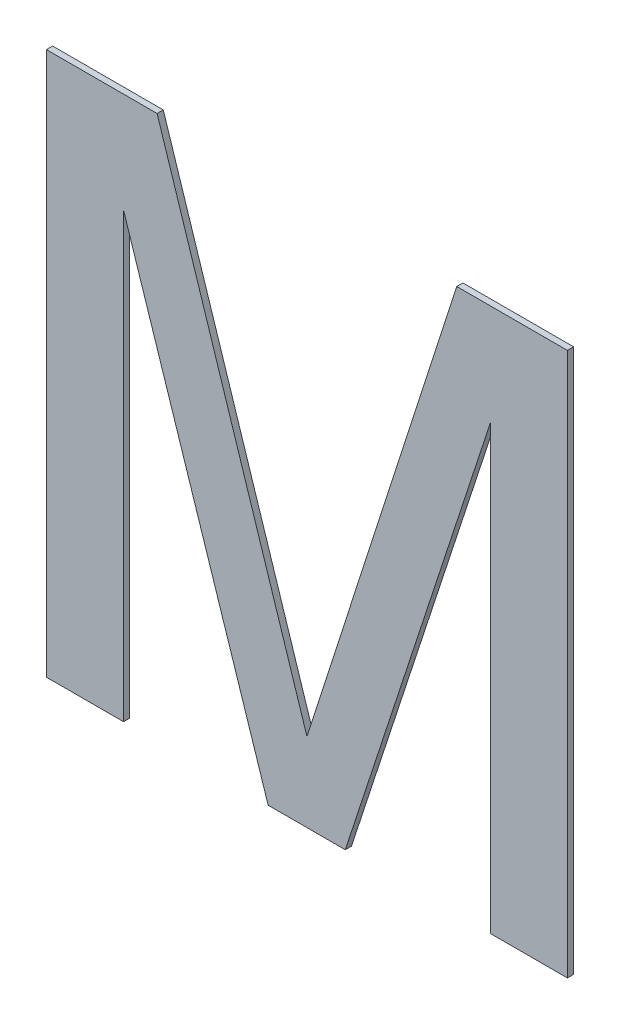
ISO-10303-21;
HEADER;
FILE_DESCRIPTION(('STEP AP214'),'2;1');
FILE_NAME('part.step','',(''),(''),'','','');
FILE_SCHEMA(('AUTOMOTIVE_DESIGN { 1 0 10303 214 1 1 1 1 }'));
ENDSEC;
DATA;
#1=APPLICATION_CONTEXT('core data for automotive mechanical design processes');
#2=APPLICATION_PROTOCOL_DEFINITION('international standard','automotive_design',2000,#1);
#3=PRODUCT_CONTEXT('',#1,'mechanical');
#4=PRODUCT('Part','Part','',(#3));
#5=PRODUCT_RELATED_PRODUCT_CATEGORY('part','',(#4));
#6=PRODUCT_DEFINITION_FORMATION('','',#4);
#7=PRODUCT_DEFINITION_CONTEXT('part definition',#1,'design');
#8=PRODUCT_DEFINITION('design','',#6,#7);
#9=PRODUCT_DEFINITION_SHAPE('','',#8);
#10=(LENGTH_UNIT() NAMED_UNIT(*) SI_UNIT(.MILLI.,.METRE.));
#11=(NAMED_UNIT(*) PLANE_ANGLE_UNIT() SI_UNIT($,.RADIAN.));
#12=(NAMED_UNIT(*) SI_UNIT($,.STERADIAN.) SOLID_ANGLE_UNIT());
#13=UNCERTAINTY_MEASURE_WITH_UNIT(LENGTH_MEASURE(1.E-05),#10,'distance_accuracy_value','');
#14=(GEOMETRIC_REPRESENTATION_CONTEXT(3) GLOBAL_UNCERTAINTY_ASSIGNED_CONTEXT((#13)) GLOBAL_UNIT_ASSIGNED_CONTEXT((#10,
#11,#12)) REPRESENTATION_CONTEXT('',''));
#15=CARTESIAN_POINT('',(0.,0.,0.));
#16=DIRECTION('',(0.,0.,1.));
#17=DIRECTION('',(1.,0.,0.));
#18=AXIS2_PLACEMENT_3D('',#15,#16,#17);
#19=CARTESIAN_POINT('',(-0.940270283559812,1.83389408249228,-3.53695));
#20=DIRECTION('',(0.,0.,1.));
#21=DIRECTION('',(1.,0.,0.));
#22=AXIS2_PLACEMENT_3D('',#19,#20,#21);
#23=PLANE('',#22);
#24=DIRECTION('',(1.,0.,0.));
#25=VECTOR('',#24,1.);
#26=CARTESIAN_POINT('',(-0.712084175447292,1.55449408249228,-3.53695));
#27=LINE('',#26,#25);
#28=CARTESIAN_POINT('',(-0.672440828517736,1.55449408249228,-3.53695));
#29=VERTEX_POINT('',#28);
#30=CARTESIAN_POINT('',(-0.751727522376848,1.55449408249228,-3.53695));
#31=VERTEX_POINT('',#30);
#32=EDGE_CURVE('E165',#29,#31,#27,.F.);
#33=ORIENTED_EDGE('',*,*,#32,.T.);
#34=DIRECTION('',(0.,1.,0.));
#35=VECTOR('',#34,1.);
#36=CARTESIAN_POINT('',(-0.751727522376848,1.78173182159044,-3.53695));
#37=LINE('',#36,#35);
#38=CARTESIAN_POINT('',(-0.751727522376849,2.00896956068861,-3.53695));
#39=VERTEX_POINT('',#38);
#40=EDGE_CURVE('E161',#31,#39,#37,.T.);
#41=ORIENTED_EDGE('',*,*,#40,.T.);
#42=DIRECTION('',(0.311703156279007,0.950179531649522,0.));
#43=VECTOR('',#42,1.);
#44=CARTESIAN_POINT('',(-0.8262720880545,1.78173182159044,-3.53695));
#45=LINE('',#44,#43);
#46=CARTESIAN_POINT('',(-0.90081665373215,1.55449408249228,-3.53695));
#47=VERTEX_POINT('',#46);
#48=EDGE_CURVE('E158',#47,#39,#45,.T.);
#49=ORIENTED_EDGE('',*,*,#48,.F.);
#50=DIRECTION('',(1.,0.,0.));
#51=VECTOR('',#50,1.);
#52=CARTESIAN_POINT('',(-0.940460000661708,1.55449408249228,-3.53695));
#53=LINE('',#52,#51);
#54=CARTESIAN_POINT('',(-0.980103347591281,1.55449408249228,-3.53695));
#55=VERTEX_POINT('',#54);
#56=EDGE_CURVE('E151',#47,#55,#53,.F.);
#57=ORIENTED_EDGE('',*,*,#56,.T.);
#58=DIRECTION('',(-0.310284971764103,0.950643590572908,0.));
#59=VECTOR('',#58,1.);
#60=CARTESIAN_POINT('',(-1.05445826278106,1.78230087297533,-3.53695));
#61=LINE('',#60,#59);
#62=CARTESIAN_POINT('',(-1.12881317797064,2.01010766345836,-3.53695));
#63=VERTEX_POINT('',#62);
#64=EDGE_CURVE('E147',#55,#63,#61,.T.);
#65=ORIENTED_EDGE('',*,*,#64,.T.);
#66=DIRECTION('',(0.,1.,0.));
#67=VECTOR('',#66,1.);
#68=CARTESIAN_POINT('',(-1.1288131779706,1.78230087297533,-3.53695));
#69=LINE('',#68,#67);
#70=CARTESIAN_POINT('',(-1.1288131779706,1.55449408249228,-3.53695));
#71=VERTEX_POINT('',#70);
#72=EDGE_CURVE('E144',#71,#63,#69,.T.);
#73=ORIENTED_EDGE('',*,*,#72,.F.);
#74=DIRECTION('',(1.,0.,0.));
#75=VECTOR('',#74,1.);
#76=CARTESIAN_POINT('',(-1.16845645828612,1.55449408249228,-3.53695));
#77=LINE('',#76,#75);
#78=CARTESIAN_POINT('',(-1.20809973860163,1.55449408249228,-3.53695));
#79=VERTEX_POINT('',#78);
#80=EDGE_CURVE('E137',#71,#79,#77,.F.);
#81=ORIENTED_EDGE('',*,*,#80,.T.);
#82=DIRECTION('',(0.,1.,0.));
#83=VECTOR('',#82,1.);
#84=CARTESIAN_POINT('',(-1.20809973860163,1.83389408249228,-3.53695));
#85=LINE('',#84,#83);
#86=CARTESIAN_POINT('',(-1.20809973860163,2.11329408249228,-3.53695));
#87=VERTEX_POINT('',#86);
#88=EDGE_CURVE('E133',#79,#87,#85,.T.);
#89=ORIENTED_EDGE('',*,*,#88,.T.);
#90=DIRECTION('',(1.,0.,0.));
#91=VECTOR('',#90,1.);
#92=CARTESIAN_POINT('',(-1.15119546609291,2.11329408249228,-3.53695));
#93=LINE('',#92,#91);
#94=CARTESIAN_POINT('',(-1.09429119358416,2.11329408249229,-3.53695));
#95=VERTEX_POINT('',#94);
#96=EDGE_CURVE('E122',#95,#87,#93,.F.);
#97=ORIENTED_EDGE('',*,*,#96,.F.);
#98=DIRECTION('',(-0.306914308852398,0.951737152275593,0.));
#99=VECTOR('',#98,1.);
#100=CARTESIAN_POINT('',(-1.01728077187889,1.8744857984362,-3.53695));
#101=LINE('',#100,#99);
#102=CARTESIAN_POINT('',(-0.940270350173881,1.63567751437991,-3.53695));
#103=VERTEX_POINT('',#102);
#104=EDGE_CURVE('E108',#103,#95,#101,.T.);
#105=ORIENTED_EDGE('',*,*,#104,.F.);
#106=DIRECTION('',(0.306914549326605,0.951737074727914,0.));
#107=VECTOR('',#106,1.);
#108=CARTESIAN_POINT('',(-0.863259861854522,1.8744857984362,-3.53695));
#109=LINE('',#108,#107);
#110=CARTESIAN_POINT('',(-0.786249373534965,2.11329408249229,-3.53695));
#111=VERTEX_POINT('',#110);
#112=EDGE_CURVE('E19',#103,#111,#109,.T.);
#113=ORIENTED_EDGE('',*,*,#112,.T.);
#114=DIRECTION('',(1.,0.,0.));
#115=VECTOR('',#114,1.);
#116=CARTESIAN_POINT('',(-0.72934510102621,2.11329408249228,-3.53695));
#117=LINE('',#116,#115);
#118=CARTESIAN_POINT('',(-0.672440828517736,2.11329408249228,-3.53695));
#119=VERTEX_POINT('',#118);
#120=EDGE_CURVE('E175',#119,#111,#117,.F.);
#121=ORIENTED_EDGE('',*,*,#120,.F.);
#122=DIRECTION('',(0.,1.,0.));
#123=VECTOR('',#122,1.);
#124=CARTESIAN_POINT('',(-0.672440828517736,1.83389408249228,-3.53695));
#125=LINE('',#124,#123);
#126=EDGE_CURVE('E172',#29,#119,#125,.T.);
#127=ORIENTED_EDGE('',*,*,#126,.F.);
#128=EDGE_LOOP('',(#33,#41,#49,#57,#65,#73,#81,#89,#97,#105,#113,#121,#127));
#129=FACE_BOUND('',#128,.T.);
#130=ADVANCED_FACE('F16',(#129),#23,.F.);
#131=CARTESIAN_POINT('',(-0.863259861854522,1.8744857984362,-3.533775));
#132=DIRECTION('',(0.951737074727914,-0.306914549326605,0.));
#133=DIRECTION('',(0.306914549326605,0.951737074727914,0.));
#134=AXIS2_PLACEMENT_3D('',#131,#132,#133);
#135=PLANE('',#134);
#136=ORIENTED_EDGE('',*,*,#112,.F.);
#137=DIRECTION('',(0.,0.,1.));
#138=VECTOR('',#137,1.);
#139=CARTESIAN_POINT('',(-0.940270350173581,1.63567751437994,-3.533775));
#140=LINE('',#139,#138);
#141=CARTESIAN_POINT('',(-0.940270350173881,1.63567751437991,-3.5306));
#142=VERTEX_POINT('',#141);
#143=EDGE_CURVE('E114',#142,#103,#140,.F.);
#144=ORIENTED_EDGE('',*,*,#143,.F.);
#145=DIRECTION('',(-0.306914549326437,-0.951737074727968,0.));
#146=VECTOR('',#145,1.);
#147=CARTESIAN_POINT('',(-0.786249373534938,2.11329408249228,-3.5306));
#148=LINE('',#147,#146);
#149=CARTESIAN_POINT('',(-0.786249373534993,2.1132940824923,-3.5306));
#150=VERTEX_POINT('',#149);
#151=EDGE_CURVE('E178',#150,#142,#148,.T.);
#152=ORIENTED_EDGE('',*,*,#151,.F.);
#153=DIRECTION('',(0.,0.,1.));
#154=VECTOR('',#153,1.);
#155=CARTESIAN_POINT('',(-0.786249373534938,2.11329408249228,-3.533775));
#156=LINE('',#155,#154);
#157=EDGE_CURVE('E117',#111,#150,#156,.T.);
#158=ORIENTED_EDGE('',*,*,#157,.F.);
#159=EDGE_LOOP('',(#136,#144,#152,#158));
#160=FACE_BOUND('',#159,.T.);
#161=ADVANCED_FACE('F113',(#160),#135,.F.);
#162=CARTESIAN_POINT('',(-1.01728077187889,1.8744857984362,-3.533775));
#163=DIRECTION('',(0.951737152275593,0.306914308852398,0.));
#164=DIRECTION('',(-0.306914308852398,0.951737152275593,0.));
#165=AXIS2_PLACEMENT_3D('',#162,#163,#164);
#166=PLANE('',#165);
#167=DIRECTION('',(0.,0.,1.));
#168=VECTOR('',#167,1.);
#169=CARTESIAN_POINT('',(-1.09429119358418,2.11329408249228,-3.533775));
#170=LINE('',#169,#168);
#171=CARTESIAN_POINT('',(-1.09429119358416,2.11329408249229,-3.5306));
#172=VERTEX_POINT('',#171);
#173=EDGE_CURVE('E124',#172,#95,#170,.F.);
#174=ORIENTED_EDGE('',*,*,#173,.F.);
#175=DIRECTION('',(-0.306914308851923,0.951737152275746,0.));
#176=VECTOR('',#175,1.);
#177=CARTESIAN_POINT('',(-0.940270350173852,1.63567751437986,-3.5306));
#178=LINE('',#177,#176);
#179=EDGE_CURVE('E128',#142,#172,#178,.T.);
#180=ORIENTED_EDGE('',*,*,#179,.F.);
#181=ORIENTED_EDGE('',*,*,#143,.T.);
#182=ORIENTED_EDGE('',*,*,#104,.T.);
#183=EDGE_LOOP('',(#174,#180,#181,#182));
#184=FACE_BOUND('',#183,.T.);
#185=ADVANCED_FACE('F126',(#184),#166,.T.);
#186=CARTESIAN_POINT('',(-1.15119546609291,2.11329408249228,-3.533775));
#187=DIRECTION('',(0.,1.,0.));
#188=DIRECTION('',(0.,0.,1.));
#189=AXIS2_PLACEMENT_3D('',#186,#187,#188);
#190=PLANE('',#189);
#191=DIRECTION('',(0.,0.,-1.));
#192=VECTOR('',#191,1.);
#193=CARTESIAN_POINT('',(-1.20809973860163,2.11329408249228,-3.533775));
#194=LINE('',#193,#192);
#195=CARTESIAN_POINT('',(-1.20809973860163,2.11329408249228,-3.5306));
#196=VERTEX_POINT('',#195);
#197=EDGE_CURVE('E135',#87,#196,#194,.F.);
#198=ORIENTED_EDGE('',*,*,#197,.T.);
#199=DIRECTION('',(1.,0.,0.));
#200=VECTOR('',#199,1.);
#201=CARTESIAN_POINT('',(-0.940270283559812,2.11329408249228,-3.5306));
#202=LINE('',#201,#200);
#203=EDGE_CURVE('E181',#172,#196,#202,.F.);
#204=ORIENTED_EDGE('',*,*,#203,.F.);
#205=ORIENTED_EDGE('',*,*,#173,.T.);
#206=ORIENTED_EDGE('',*,*,#96,.T.);
#207=EDGE_LOOP('',(#198,#204,#205,#206));
#208=FACE_BOUND('',#207,.T.);
#209=ADVANCED_FACE('F259',(#208),#190,.T.);
#210=CARTESIAN_POINT('',(-1.20809973860163,1.83389408249228,-3.533775));
#211=DIRECTION('',(1.,0.,0.));
#212=DIRECTION('',(0.,0.,-1.));
#213=AXIS2_PLACEMENT_3D('',#210,#211,#212);
#214=PLANE('',#213);
#215=ORIENTED_EDGE('',*,*,#88,.F.);
#216=DIRECTION('',(0.,0.,1.));
#217=VECTOR('',#216,1.);
#218=CARTESIAN_POINT('',(-1.20809973860163,1.55449408249228,-3.533775));
#219=LINE('',#218,#217);
#220=CARTESIAN_POINT('',(-1.20809973860163,1.55449408249228,-3.5306));
#221=VERTEX_POINT('',#220);
#222=EDGE_CURVE('E139',#79,#221,#219,.T.);
#223=ORIENTED_EDGE('',*,*,#222,.T.);
#224=DIRECTION('',(0.,1.,0.));
#225=VECTOR('',#224,1.);
#226=CARTESIAN_POINT('',(-1.20809973860163,1.83389408249228,-3.5306));
#227=LINE('',#226,#225);
#228=EDGE_CURVE('E184',#196,#221,#227,.F.);
#229=ORIENTED_EDGE('',*,*,#228,.F.);
#230=ORIENTED_EDGE('',*,*,#197,.F.);
#231=EDGE_LOOP('',(#215,#223,#229,#230));
#232=FACE_BOUND('',#231,.T.);
#233=ADVANCED_FACE('F255',(#232),#214,.F.);
#234=CARTESIAN_POINT('',(-1.16845645828612,1.55449408249228,-3.533775));
#235=DIRECTION('',(0.,1.,0.));
#236=DIRECTION('',(0.,0.,1.));
#237=AXIS2_PLACEMENT_3D('',#234,#235,#236);
#238=PLANE('',#237);
#239=ORIENTED_EDGE('',*,*,#80,.F.);
#240=DIRECTION('',(0.,0.,-1.));
#241=VECTOR('',#240,1.);
#242=CARTESIAN_POINT('',(-1.1288131779706,1.55449408249228,-3.533775));
#243=LINE('',#242,#241);
#244=CARTESIAN_POINT('',(-1.1288131779706,1.55449408249228,-3.5306));
#245=VERTEX_POINT('',#244);
#246=EDGE_CURVE('E141',#245,#71,#243,.T.);
#247=ORIENTED_EDGE('',*,*,#246,.F.);
#248=DIRECTION('',(1.,0.,0.));
#249=VECTOR('',#248,1.);
#250=CARTESIAN_POINT('',(-0.940270283559812,1.55449408249228,-3.5306));
#251=LINE('',#250,#249);
#252=EDGE_CURVE('E187',#221,#245,#251,.T.);
#253=ORIENTED_EDGE('',*,*,#252,.F.);
#254=ORIENTED_EDGE('',*,*,#222,.F.);
#255=EDGE_LOOP('',(#239,#247,#253,#254));
#256=FACE_BOUND('',#255,.T.);
#257=ADVANCED_FACE('F251',(#256),#238,.F.);
#258=CARTESIAN_POINT('',(-1.1288131779706,1.78230087297533,-3.533775));
#259=DIRECTION('',(1.,0.,0.));
#260=DIRECTION('',(0.,0.,-1.));
#261=AXIS2_PLACEMENT_3D('',#258,#259,#260);
#262=PLANE('',#261);
#263=DIRECTION('',(0.,0.,1.));
#264=VECTOR('',#263,1.);
#265=CARTESIAN_POINT('',(-1.12881317797077,2.01010766345832,-3.533775));
#266=LINE('',#265,#264);
#267=CARTESIAN_POINT('',(-1.12881317797064,2.01010766345836,-3.5306));
#268=VERTEX_POINT('',#267);
#269=EDGE_CURVE('E149',#63,#268,#266,.T.);
#270=ORIENTED_EDGE('',*,*,#269,.T.);
#271=DIRECTION('',(0.,1.,0.));
#272=VECTOR('',#271,1.);
#273=CARTESIAN_POINT('',(-1.1288131779706,1.83389408249228,-3.5306));
#274=LINE('',#273,#272);
#275=EDGE_CURVE('E190',#245,#268,#274,.T.);
#276=ORIENTED_EDGE('',*,*,#275,.F.);
#277=ORIENTED_EDGE('',*,*,#246,.T.);
#278=ORIENTED_EDGE('',*,*,#72,.T.);
#279=EDGE_LOOP('',(#270,#276,#277,#278));
#280=FACE_BOUND('',#279,.T.);
#281=ADVANCED_FACE('F247',(#280),#262,.T.);
#282=CARTESIAN_POINT('',(-1.05445826278106,1.78230087297533,-3.533775));
#283=DIRECTION('',(0.950643590572908,0.310284971764103,0.));
#284=DIRECTION('',(-0.310284971764103,0.950643590572908,0.));
#285=AXIS2_PLACEMENT_3D('',#282,#283,#284);
#286=PLANE('',#285);
#287=ORIENTED_EDGE('',*,*,#64,.F.);
#288=DIRECTION('',(0.,0.,1.));
#289=VECTOR('',#288,1.);
#290=CARTESIAN_POINT('',(-0.980103347591264,1.55449408249228,-3.533775));
#291=LINE('',#290,#289);
#292=CARTESIAN_POINT('',(-0.980103347591297,1.55449408249227,-3.5306));
#293=VERTEX_POINT('',#292);
#294=EDGE_CURVE('E153',#55,#293,#291,.T.);
#295=ORIENTED_EDGE('',*,*,#294,.T.);
#296=DIRECTION('',(0.3102849717639,-0.950643590572974,0.));
#297=VECTOR('',#296,1.);
#298=CARTESIAN_POINT('',(-1.1288131779706,2.01010766345837,-3.5306));
#299=LINE('',#298,#297);
#300=EDGE_CURVE('E193',#268,#293,#299,.T.);
#301=ORIENTED_EDGE('',*,*,#300,.F.);
#302=ORIENTED_EDGE('',*,*,#269,.F.);
#303=EDGE_LOOP('',(#287,#295,#301,#302));
#304=FACE_BOUND('',#303,.T.);
#305=ADVANCED_FACE('F243',(#304),#286,.F.);
#306=CARTESIAN_POINT('',(-0.940460000661708,1.55449408249228,-3.533775));
#307=DIRECTION('',(0.,1.,0.));
#308=DIRECTION('',(0.,0.,1.));
#309=AXIS2_PLACEMENT_3D('',#306,#307,#308);
#310=PLANE('',#309);
#311=ORIENTED_EDGE('',*,*,#56,.F.);
#312=DIRECTION('',(0.,0.,1.));
#313=VECTOR('',#312,1.);
#314=CARTESIAN_POINT('',(-0.900816653732147,1.55449408249228,-3.533775));
#315=LINE('',#314,#313);
#316=CARTESIAN_POINT('',(-0.90081665373215,1.55449408249228,-3.5306));
#317=VERTEX_POINT('',#316);
#318=EDGE_CURVE('E155',#317,#47,#315,.F.);
#319=ORIENTED_EDGE('',*,*,#318,.F.);
#320=DIRECTION('',(1.,0.,0.));
#321=VECTOR('',#320,1.);
#322=CARTESIAN_POINT('',(-0.940270283559812,1.55449408249228,-3.5306));
#323=LINE('',#322,#321);
#324=EDGE_CURVE('E196',#293,#317,#323,.T.);
#325=ORIENTED_EDGE('',*,*,#324,.F.);
#326=ORIENTED_EDGE('',*,*,#294,.F.);
#327=EDGE_LOOP('',(#311,#319,#325,#326));
#328=FACE_BOUND('',#327,.T.);
#329=ADVANCED_FACE('F239',(#328),#310,.F.);
#330=CARTESIAN_POINT('',(-0.8262720880545,1.78173182159044,-3.533775));
#331=DIRECTION('',(0.950179531649522,-0.311703156279007,0.));
#332=DIRECTION('',(0.311703156279007,0.950179531649522,0.));
#333=AXIS2_PLACEMENT_3D('',#330,#331,#332);
#334=PLANE('',#333);
#335=DIRECTION('',(0.,0.,-1.));
#336=VECTOR('',#335,1.);
#337=CARTESIAN_POINT('',(-0.751727522376848,2.00896956068861,-3.533775));
#338=LINE('',#337,#336);
#339=CARTESIAN_POINT('',(-0.751727522376851,2.00896956068861,-3.5306));
#340=VERTEX_POINT('',#339);
#341=EDGE_CURVE('E163',#39,#340,#338,.F.);
#342=ORIENTED_EDGE('',*,*,#341,.T.);
#343=DIRECTION('',(0.31170315627903,0.950179531649514,0.));
#344=VECTOR('',#343,1.);
#345=CARTESIAN_POINT('',(-0.900816653732152,1.55449408249228,-3.5306));
#346=LINE('',#345,#344);
#347=EDGE_CURVE('E199',#317,#340,#346,.T.);
#348=ORIENTED_EDGE('',*,*,#347,.F.);
#349=ORIENTED_EDGE('',*,*,#318,.T.);
#350=ORIENTED_EDGE('',*,*,#48,.T.);
#351=EDGE_LOOP('',(#342,#348,#349,#350));
#352=FACE_BOUND('',#351,.T.);
#353=ADVANCED_FACE('F235',(#352),#334,.T.);
#354=CARTESIAN_POINT('',(-0.751727522376848,1.78173182159044,-3.533775));
#355=DIRECTION('',(1.,0.,0.));
#356=DIRECTION('',(0.,0.,-1.));
#357=AXIS2_PLACEMENT_3D('',#354,#355,#356);
#358=PLANE('',#357);
#359=ORIENTED_EDGE('',*,*,#40,.F.);
#360=DIRECTION('',(0.,0.,1.));
#361=VECTOR('',#360,1.);
#362=CARTESIAN_POINT('',(-0.751727522376848,1.55449408249228,-3.533775));
#363=LINE('',#362,#361);
#364=CARTESIAN_POINT('',(-0.751727522376848,1.55449408249228,-3.5306));
#365=VERTEX_POINT('',#364);
#366=EDGE_CURVE('E167',#31,#365,#363,.T.);
#367=ORIENTED_EDGE('',*,*,#366,.T.);
#368=DIRECTION('',(0.,1.,0.));
#369=VECTOR('',#368,1.);
#370=CARTESIAN_POINT('',(-0.751727522376848,1.83389408249228,-3.5306));
#371=LINE('',#370,#369);
#372=EDGE_CURVE('E202',#340,#365,#371,.F.);
#373=ORIENTED_EDGE('',*,*,#372,.F.);
#374=ORIENTED_EDGE('',*,*,#341,.F.);
#375=EDGE_LOOP('',(#359,#367,#373,#374));
#376=FACE_BOUND('',#375,.T.);
#377=ADVANCED_FACE('F232',(#376),#358,.F.);
#378=CARTESIAN_POINT('',(-0.712084175447292,1.55449408249228,-3.533775));
#379=DIRECTION('',(0.,1.,0.));
#380=DIRECTION('',(0.,0.,1.));
#381=AXIS2_PLACEMENT_3D('',#378,#379,#380);
#382=PLANE('',#381);
#383=ORIENTED_EDGE('',*,*,#32,.F.);
#384=DIRECTION('',(0.,0.,-1.));
#385=VECTOR('',#384,1.);
#386=CARTESIAN_POINT('',(-0.672440828517736,1.55449408249228,-3.533775));
#387=LINE('',#386,#385);
#388=CARTESIAN_POINT('',(-0.672440828517736,1.55449408249228,-3.5306));
#389=VERTEX_POINT('',#388);
#390=EDGE_CURVE('E169',#389,#29,#387,.T.);
#391=ORIENTED_EDGE('',*,*,#390,.F.);
#392=DIRECTION('',(1.,0.,0.));
#393=VECTOR('',#392,1.);
#394=CARTESIAN_POINT('',(-0.940270283559812,1.55449408249228,-3.5306));
#395=LINE('',#394,#393);
#396=EDGE_CURVE('E205',#365,#389,#395,.T.);
#397=ORIENTED_EDGE('',*,*,#396,.F.);
#398=ORIENTED_EDGE('',*,*,#366,.F.);
#399=EDGE_LOOP('',(#383,#391,#397,#398));
#400=FACE_BOUND('',#399,.T.);
#401=ADVANCED_FACE('F215',(#400),#382,.F.);
#402=CARTESIAN_POINT('',(-0.672440828517736,1.83389408249228,-3.533775));
#403=DIRECTION('',(1.,0.,0.));
#404=DIRECTION('',(0.,0.,-1.));
#405=AXIS2_PLACEMENT_3D('',#402,#403,#404);
#406=PLANE('',#405);
#407=DIRECTION('',(0.,0.,1.));
#408=VECTOR('',#407,1.);
#409=CARTESIAN_POINT('',(-0.672440828517736,2.11329408249228,-3.533775));
#410=LINE('',#409,#408);
#411=CARTESIAN_POINT('',(-0.672440828517736,2.11329408249228,-3.5306));
#412=VERTEX_POINT('',#411);
#413=EDGE_CURVE('E34',#412,#119,#410,.F.);
#414=ORIENTED_EDGE('',*,*,#413,.F.);
#415=DIRECTION('',(0.,1.,0.));
#416=VECTOR('',#415,1.);
#417=CARTESIAN_POINT('',(-0.672440828517736,1.83389408249228,-3.5306));
#418=LINE('',#417,#416);
#419=EDGE_CURVE('E25',#389,#412,#418,.T.);
#420=ORIENTED_EDGE('',*,*,#419,.F.);
#421=ORIENTED_EDGE('',*,*,#390,.T.);
#422=ORIENTED_EDGE('',*,*,#126,.T.);
#423=EDGE_LOOP('',(#414,#420,#421,#422));
#424=FACE_BOUND('',#423,.T.);
#425=ADVANCED_FACE('F212',(#424),#406,.T.);
#426=CARTESIAN_POINT('',(-0.72934510102621,2.11329408249228,-3.533775));
#427=DIRECTION('',(0.,1.,0.));
#428=DIRECTION('',(0.,0.,1.));
#429=AXIS2_PLACEMENT_3D('',#426,#427,#428);
#430=PLANE('',#429);
#431=ORIENTED_EDGE('',*,*,#157,.T.);
#432=DIRECTION('',(1.,0.,0.));
#433=VECTOR('',#432,1.);
#434=CARTESIAN_POINT('',(-0.940270283559812,2.11329408249228,-3.5306));
#435=LINE('',#434,#433);
#436=EDGE_CURVE('E11',#412,#150,#435,.F.);
#437=ORIENTED_EDGE('',*,*,#436,.F.);
#438=ORIENTED_EDGE('',*,*,#413,.T.);
#439=ORIENTED_EDGE('',*,*,#120,.T.);
#440=EDGE_LOOP('',(#431,#437,#438,#439));
#441=FACE_BOUND('',#440,.T.);
#442=ADVANCED_FACE('F219',(#441),#430,.T.);
#443=CARTESIAN_POINT('',(-0.940270283559812,1.83389408249228,-3.5306));
#444=DIRECTION('',(0.,0.,1.));
#445=DIRECTION('',(1.,0.,0.));
#446=AXIS2_PLACEMENT_3D('',#443,#444,#445);
#447=PLANE('',#446);
#448=ORIENTED_EDGE('',*,*,#419,.T.);
#449=ORIENTED_EDGE('',*,*,#436,.T.);
#450=ORIENTED_EDGE('',*,*,#151,.T.);
#451=ORIENTED_EDGE('',*,*,#179,.T.);
#452=ORIENTED_EDGE('',*,*,#203,.T.);
#453=ORIENTED_EDGE('',*,*,#228,.T.);
#454=ORIENTED_EDGE('',*,*,#252,.T.);
#455=ORIENTED_EDGE('',*,*,#275,.T.);
#456=ORIENTED_EDGE('',*,*,#300,.T.);
#457=ORIENTED_EDGE('',*,*,#324,.T.);
#458=ORIENTED_EDGE('',*,*,#347,.T.);
#459=ORIENTED_EDGE('',*,*,#372,.T.);
#460=ORIENTED_EDGE('',*,*,#396,.T.);
#461=EDGE_LOOP('',(#448,#449,#450,#451,#452,#453,#454,#455,#456,#457,#458,#459,#460));
#462=FACE_BOUND('',#461,.T.);
#463=ADVANCED_FACE('F210',(#462),#447,.T.);
#464=CLOSED_SHELL('',(#130,#161,#185,#209,#233,#257,#281,#305,#329,#353,#377,#401,#425,#442,#463));
#465=MANIFOLD_SOLID_BREP('B1',#464);
#466=ADVANCED_BREP_SHAPE_REPRESENTATION('',(#18,#465),#14);
#467=SHAPE_DEFINITION_REPRESENTATION(#9,#466);
ENDSEC;
END-ISO-10303-21;
